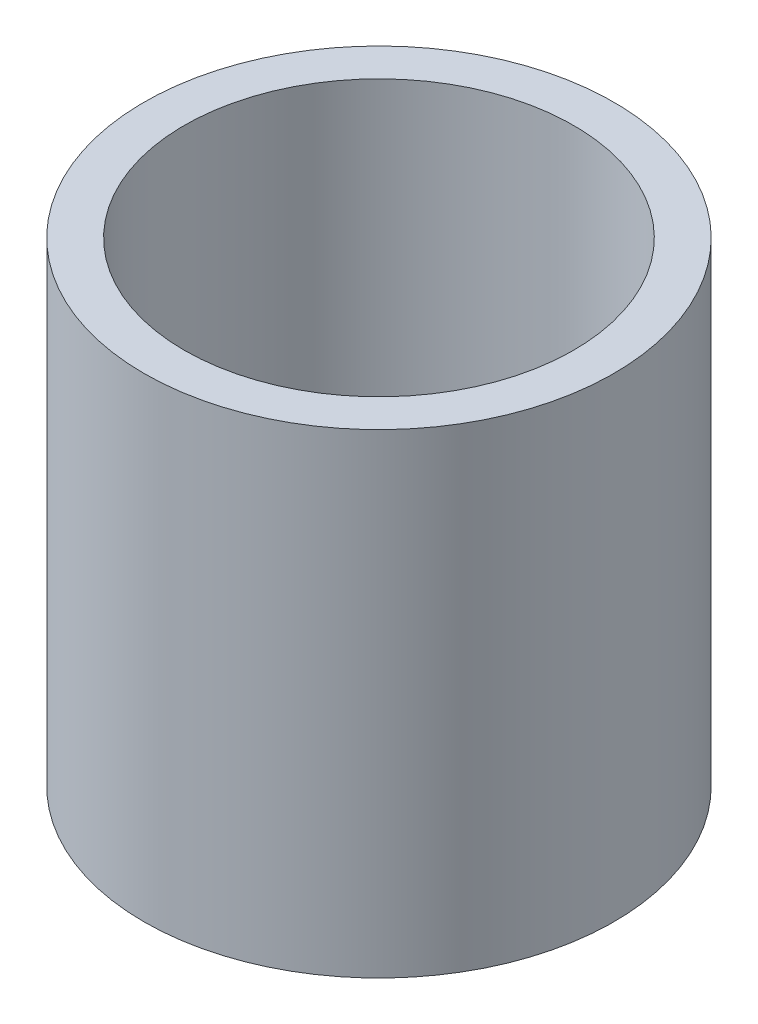
ISO-10303-21;
HEADER;
FILE_DESCRIPTION(('STEP AP214'),'2;1');
FILE_NAME('part.step','',(''),(''),'','','');
FILE_SCHEMA(('AUTOMOTIVE_DESIGN { 1 0 10303 214 1 1 1 1 }'));
ENDSEC;
DATA;
#1=APPLICATION_CONTEXT('core data for automotive mechanical design processes');
#2=APPLICATION_PROTOCOL_DEFINITION('international standard','automotive_design',2000,#1);
#3=PRODUCT_CONTEXT('',#1,'mechanical');
#4=PRODUCT('Part','Part','',(#3));
#5=PRODUCT_RELATED_PRODUCT_CATEGORY('part','',(#4));
#6=PRODUCT_DEFINITION_FORMATION('','',#4);
#7=PRODUCT_DEFINITION_CONTEXT('part definition',#1,'design');
#8=PRODUCT_DEFINITION('design','',#6,#7);
#9=PRODUCT_DEFINITION_SHAPE('','',#8);
#10=(LENGTH_UNIT() NAMED_UNIT(*) SI_UNIT(.MILLI.,.METRE.));
#11=(NAMED_UNIT(*) PLANE_ANGLE_UNIT() SI_UNIT($,.RADIAN.));
#12=(NAMED_UNIT(*) SI_UNIT($,.STERADIAN.) SOLID_ANGLE_UNIT());
#13=UNCERTAINTY_MEASURE_WITH_UNIT(LENGTH_MEASURE(1.E-05),#10,'distance_accuracy_value','');
#14=(GEOMETRIC_REPRESENTATION_CONTEXT(3) GLOBAL_UNCERTAINTY_ASSIGNED_CONTEXT((#13)) GLOBAL_UNIT_ASSIGNED_CONTEXT((#10,
#11,#12)) REPRESENTATION_CONTEXT('',''));
#15=CARTESIAN_POINT('',(0.,0.,0.));
#16=DIRECTION('',(0.,0.,1.));
#17=DIRECTION('',(1.,0.,0.));
#18=AXIS2_PLACEMENT_3D('',#15,#16,#17);
#19=CARTESIAN_POINT('',(0.,35.3782207228084,0.));
#20=DIRECTION('',(0.,-1.,0.));
#21=DIRECTION('',(0.,0.,-1.));
#22=AXIS2_PLACEMENT_3D('',#19,#20,#21);
#23=CYLINDRICAL_SURFACE('',#22,17.5);
#24=CARTESIAN_POINT('',(0.,35.3782207228084,0.));
#25=DIRECTION('',(0.,1.,0.));
#26=DIRECTION('',(0.,0.,1.));
#27=AXIS2_PLACEMENT_3D('',#24,#25,#26);
#28=CIRCLE('',#27,17.5);
#29=CARTESIAN_POINT('',(0.,35.3782207228084,17.5));
#30=VERTEX_POINT('',#29);
#31=EDGE_CURVE('E10',#30,#30,#28,.T.);
#32=ORIENTED_EDGE('',*,*,#31,.F.);
#33=EDGE_LOOP('',(#32));
#34=FACE_BOUND('',#33,.T.);
#35=CARTESIAN_POINT('',(0.,0.,0.));
#36=DIRECTION('',(0.,1.,0.));
#37=DIRECTION('',(0.,0.,1.));
#38=AXIS2_PLACEMENT_3D('',#35,#36,#37);
#39=CIRCLE('',#38,17.5);
#40=CARTESIAN_POINT('',(0.,0.,17.5));
#41=VERTEX_POINT('',#40);
#42=EDGE_CURVE('E37',#41,#41,#39,.T.);
#43=ORIENTED_EDGE('',*,*,#42,.T.);
#44=EDGE_LOOP('',(#43));
#45=FACE_BOUND('',#44,.T.);
#46=ADVANCED_FACE('F40',(#34,#45),#23,.T.);
#47=CARTESIAN_POINT('',(0.,35.3782207228084,0.));
#48=DIRECTION('',(0.,1.,0.));
#49=DIRECTION('',(0.,0.,1.));
#50=AXIS2_PLACEMENT_3D('',#47,#48,#49);
#51=PLANE('',#50);
#52=CARTESIAN_POINT('',(0.,35.3782207228084,0.));
#53=DIRECTION('',(0.,1.,0.));
#54=DIRECTION('',(0.,0.,1.));
#55=AXIS2_PLACEMENT_3D('',#52,#53,#54);
#56=CIRCLE('',#55,14.5049727833686);
#57=CARTESIAN_POINT('',(0.,35.3782207228084,14.5049727833686));
#58=VERTEX_POINT('',#57);
#59=EDGE_CURVE('E50',#58,#58,#56,.T.);
#60=ORIENTED_EDGE('',*,*,#59,.F.);
#61=EDGE_LOOP('',(#60));
#62=FACE_BOUND('',#61,.T.);
#63=ORIENTED_EDGE('',*,*,#31,.T.);
#64=EDGE_LOOP('',(#63));
#65=FACE_BOUND('',#64,.T.);
#66=ADVANCED_FACE('F59',(#62,#65),#51,.T.);
#67=CARTESIAN_POINT('',(0.,0.,0.));
#68=DIRECTION('',(0.,1.,0.));
#69=DIRECTION('',(0.,0.,1.));
#70=AXIS2_PLACEMENT_3D('',#67,#68,#69);
#71=PLANE('',#70);
#72=CARTESIAN_POINT('',(0.,0.,0.));
#73=DIRECTION('',(0.,1.,0.));
#74=DIRECTION('',(0.,0.,1.));
#75=AXIS2_PLACEMENT_3D('',#72,#73,#74);
#76=CIRCLE('',#75,14.5049727833686);
#77=CARTESIAN_POINT('',(0.,0.,14.5049727833686));
#78=VERTEX_POINT('',#77);
#79=EDGE_CURVE('E47',#78,#78,#76,.T.);
#80=ORIENTED_EDGE('',*,*,#79,.T.);
#81=EDGE_LOOP('',(#80));
#82=FACE_BOUND('',#81,.T.);
#83=ORIENTED_EDGE('',*,*,#42,.F.);
#84=EDGE_LOOP('',(#83));
#85=FACE_BOUND('',#84,.T.);
#86=ADVANCED_FACE('F58',(#82,#85),#71,.F.);
#87=CARTESIAN_POINT('',(0.,35.3782207228084,0.));
#88=DIRECTION('',(0.,-1.,0.));
#89=DIRECTION('',(0.,0.,-1.));
#90=AXIS2_PLACEMENT_3D('',#87,#88,#89);
#91=CYLINDRICAL_SURFACE('',#90,14.5049727833686);
#92=ORIENTED_EDGE('',*,*,#59,.T.);
#93=EDGE_LOOP('',(#92));
#94=FACE_BOUND('',#93,.T.);
#95=ORIENTED_EDGE('',*,*,#79,.F.);
#96=EDGE_LOOP('',(#95));
#97=FACE_BOUND('',#96,.T.);
#98=ADVANCED_FACE('F54',(#94,#97),#91,.F.);
#99=CLOSED_SHELL('',(#46,#66,#86,#98));
#100=MANIFOLD_SOLID_BREP('B2',#99);
#101=ADVANCED_BREP_SHAPE_REPRESENTATION('',(#18,#100),#14);
#102=SHAPE_DEFINITION_REPRESENTATION(#9,#101);
ENDSEC;
END-ISO-10303-21;
